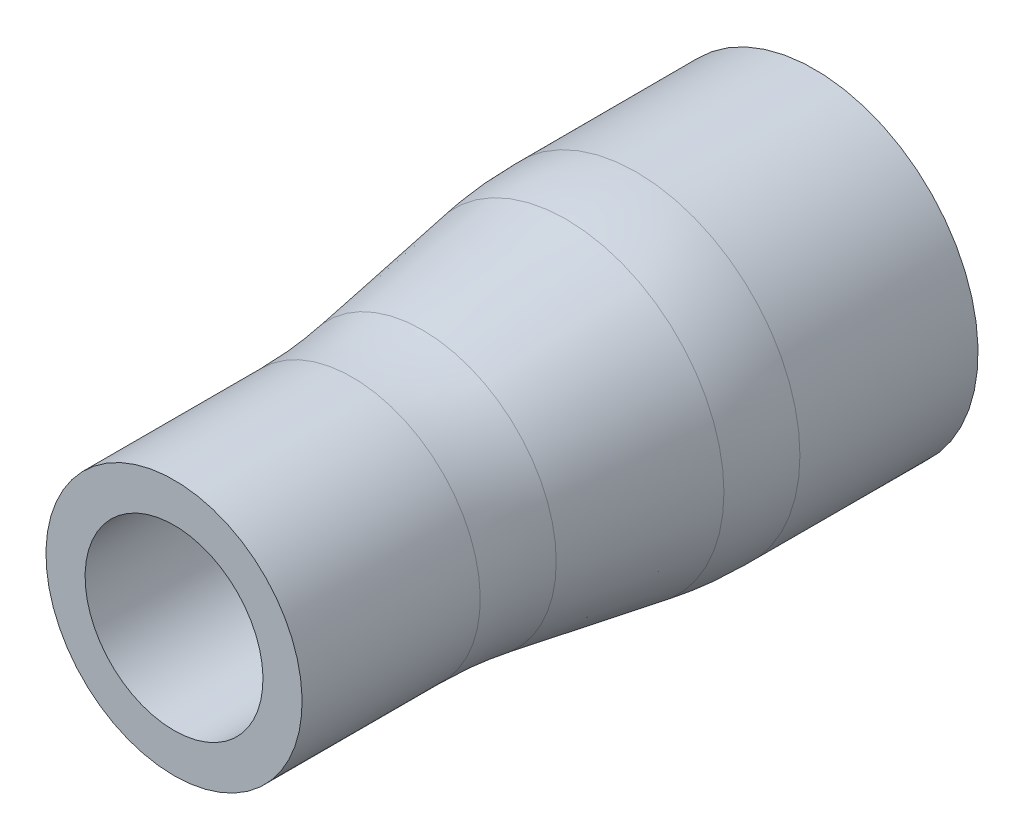
ISO-10303-21;
HEADER;
FILE_DESCRIPTION(('STEP AP214'),'2;1');
FILE_NAME('part.step','',(''),(''),'','','');
FILE_SCHEMA(('AUTOMOTIVE_DESIGN { 1 0 10303 214 1 1 1 1 }'));
ENDSEC;
DATA;
#1=APPLICATION_CONTEXT('core data for automotive mechanical design processes');
#2=APPLICATION_PROTOCOL_DEFINITION('international standard','automotive_design',2000,#1);
#3=PRODUCT_CONTEXT('',#1,'mechanical');
#4=PRODUCT('Part','Part','',(#3));
#5=PRODUCT_RELATED_PRODUCT_CATEGORY('part','',(#4));
#6=PRODUCT_DEFINITION_FORMATION('','',#4);
#7=PRODUCT_DEFINITION_CONTEXT('part definition',#1,'design');
#8=PRODUCT_DEFINITION('design','',#6,#7);
#9=PRODUCT_DEFINITION_SHAPE('','',#8);
#10=(LENGTH_UNIT() NAMED_UNIT(*) SI_UNIT(.MILLI.,.METRE.));
#11=(NAMED_UNIT(*) PLANE_ANGLE_UNIT() SI_UNIT($,.RADIAN.));
#12=(NAMED_UNIT(*) SI_UNIT($,.STERADIAN.) SOLID_ANGLE_UNIT());
#13=UNCERTAINTY_MEASURE_WITH_UNIT(LENGTH_MEASURE(1.E-05),#10,'distance_accuracy_value','');
#14=(GEOMETRIC_REPRESENTATION_CONTEXT(3) GLOBAL_UNCERTAINTY_ASSIGNED_CONTEXT((#13)) GLOBAL_UNIT_ASSIGNED_CONTEXT((#10,
#11,#12)) REPRESENTATION_CONTEXT('',''));
#15=CARTESIAN_POINT('',(0.,0.,0.));
#16=DIRECTION('',(0.,0.,1.));
#17=DIRECTION('',(1.,0.,0.));
#18=AXIS2_PLACEMENT_3D('',#15,#16,#17);
#19=CARTESIAN_POINT('',(0.,11.43,28.575));
#20=DIRECTION('',(0.,0.,-1.));
#21=DIRECTION('',(0.,1.,0.));
#22=AXIS2_PLACEMENT_3D('',#19,#20,#21);
#23=PLANE('',#22);
#24=CARTESIAN_POINT('',(0.,0.,28.575));
#25=DIRECTION('',(0.,0.,1.));
#26=DIRECTION('',(0.,-1.,0.));
#27=AXIS2_PLACEMENT_3D('',#24,#25,#26);
#28=CIRCLE('',#27,7.9375);
#29=CARTESIAN_POINT('',(0.,-7.9375,28.575));
#30=VERTEX_POINT('',#29);
#31=EDGE_CURVE('E66',#30,#30,#28,.T.);
#32=ORIENTED_EDGE('',*,*,#31,.F.);
#33=EDGE_LOOP('',(#32));
#34=FACE_BOUND('',#33,.T.);
#35=CARTESIAN_POINT('',(0.,0.,28.575));
#36=DIRECTION('',(0.,0.,1.));
#37=DIRECTION('',(0.,-1.,0.));
#38=AXIS2_PLACEMENT_3D('',#35,#36,#37);
#39=CIRCLE('',#38,11.43);
#40=CARTESIAN_POINT('',(0.,-11.43,28.575));
#41=VERTEX_POINT('',#40);
#42=EDGE_CURVE('E75',#41,#41,#39,.T.);
#43=ORIENTED_EDGE('',*,*,#42,.T.);
#44=EDGE_LOOP('',(#43));
#45=FACE_BOUND('',#44,.T.);
#46=ADVANCED_FACE('F34',(#34,#45),#23,.F.);
#47=CARTESIAN_POINT('',(0.,0.,28.575));
#48=DIRECTION('',(0.,0.,1.));
#49=DIRECTION('',(0.,-1.,0.));
#50=AXIS2_PLACEMENT_3D('',#47,#48,#49);
#51=CYLINDRICAL_SURFACE('',#50,7.9375);
#52=CARTESIAN_POINT('',(0.,0.,11.1097534519865));
#53=DIRECTION('',(0.,0.,-1.));
#54=DIRECTION('',(0.,1.,0.));
#55=AXIS2_PLACEMENT_3D('',#52,#53,#54);
#56=CIRCLE('',#55,7.9375);
#57=CARTESIAN_POINT('',(0.,7.9375,11.1097534519865));
#58=VERTEX_POINT('',#57);
#59=EDGE_CURVE('E57',#58,#58,#56,.T.);
#60=ORIENTED_EDGE('',*,*,#59,.T.);
#61=EDGE_LOOP('',(#60));
#62=FACE_BOUND('',#61,.T.);
#63=ORIENTED_EDGE('',*,*,#31,.T.);
#64=EDGE_LOOP('',(#63));
#65=FACE_BOUND('',#64,.T.);
#66=ADVANCED_FACE('F96',(#62,#65),#51,.F.);
#67=CARTESIAN_POINT('',(0.,0.,9.525));
#68=DIRECTION('',(0.,0.,-1.));
#69=DIRECTION('',(0.,1.,0.));
#70=AXIS2_PLACEMENT_3D('',#67,#68,#69);
#71=CONICAL_SURFACE('',#70,7.9375,0.0831412318884409);
#72=CARTESIAN_POINT('',(0.,0.,7.94572066955904));
#73=DIRECTION('',(0.,0.,1.));
#74=DIRECTION('',(0.,-1.,0.));
#75=AXIS2_PLACEMENT_3D('',#72,#73,#74);
#76=CIRCLE('',#75,8.06910661087008);
#77=CARTESIAN_POINT('',(0.,-8.06910661087007,7.94572066955903));
#78=VERTEX_POINT('',#77);
#79=EDGE_CURVE('E60',#78,#78,#76,.T.);
#80=ORIENTED_EDGE('',*,*,#79,.T.);
#81=EDGE_LOOP('',(#80));
#82=FACE_BOUND('',#81,.T.);
#83=CARTESIAN_POINT('',(0.,0.,-7.94572066955905));
#84=DIRECTION('',(0.,0.,-1.));
#85=DIRECTION('',(0.,1.,0.));
#86=AXIS2_PLACEMENT_3D('',#83,#84,#85);
#87=CIRCLE('',#86,9.39339338912991);
#88=CARTESIAN_POINT('',(0.,9.39339338912992,-7.94572066955905));
#89=VERTEX_POINT('',#88);
#90=EDGE_CURVE('E63',#89,#89,#87,.T.);
#91=ORIENTED_EDGE('',*,*,#90,.T.);
#92=EDGE_LOOP('',(#91));
#93=FACE_BOUND('',#92,.T.);
#94=ADVANCED_FACE('F102',(#82,#93),#71,.F.);
#95=CARTESIAN_POINT('',(0.,0.,28.575));
#96=DIRECTION('',(0.,0.,1.));
#97=DIRECTION('',(0.,-1.,0.));
#98=AXIS2_PLACEMENT_3D('',#95,#96,#97);
#99=CYLINDRICAL_SURFACE('',#98,9.52499999999999);
#100=CARTESIAN_POINT('',(0.,0.,-11.1097534519865));
#101=DIRECTION('',(0.,0.,1.));
#102=DIRECTION('',(0.,-1.,0.));
#103=AXIS2_PLACEMENT_3D('',#100,#101,#102);
#104=CIRCLE('',#103,9.52499999999999);
#105=CARTESIAN_POINT('',(0.,-9.52499999999998,-11.1097534519865));
#106=VERTEX_POINT('',#105);
#107=EDGE_CURVE('E54',#106,#106,#104,.T.);
#108=ORIENTED_EDGE('',*,*,#107,.T.);
#109=EDGE_LOOP('',(#108));
#110=FACE_BOUND('',#109,.T.);
#111=CARTESIAN_POINT('',(0.,0.,-28.575));
#112=DIRECTION('',(0.,0.,1.));
#113=DIRECTION('',(0.,-1.,0.));
#114=AXIS2_PLACEMENT_3D('',#111,#112,#113);
#115=CIRCLE('',#114,9.52499999999999);
#116=CARTESIAN_POINT('',(0.,-9.52499999999998,-28.575));
#117=VERTEX_POINT('',#116);
#118=EDGE_CURVE('E69',#117,#117,#115,.T.);
#119=ORIENTED_EDGE('',*,*,#118,.F.);
#120=EDGE_LOOP('',(#119));
#121=FACE_BOUND('',#120,.T.);
#122=ADVANCED_FACE('F166',(#110,#121),#99,.F.);
#123=CARTESIAN_POINT('',(0.,14.605,-28.575));
#124=DIRECTION('',(0.,0.,1.));
#125=DIRECTION('',(0.,-1.,0.));
#126=AXIS2_PLACEMENT_3D('',#123,#124,#125);
#127=PLANE('',#126);
#128=CARTESIAN_POINT('',(0.,0.,-28.575));
#129=DIRECTION('',(0.,0.,1.));
#130=DIRECTION('',(0.,-1.,0.));
#131=AXIS2_PLACEMENT_3D('',#128,#129,#130);
#132=CIRCLE('',#131,14.605);
#133=CARTESIAN_POINT('',(0.,-14.605,-28.575));
#134=VERTEX_POINT('',#133);
#135=EDGE_CURVE('E72',#134,#134,#132,.T.);
#136=ORIENTED_EDGE('',*,*,#135,.F.);
#137=EDGE_LOOP('',(#136));
#138=FACE_BOUND('',#137,.T.);
#139=ORIENTED_EDGE('',*,*,#118,.T.);
#140=EDGE_LOOP('',(#139));
#141=FACE_BOUND('',#140,.T.);
#142=ADVANCED_FACE('F159',(#138,#141),#127,.F.);
#143=CARTESIAN_POINT('',(0.,0.,28.575));
#144=DIRECTION('',(0.,0.,1.));
#145=DIRECTION('',(0.,-1.,0.));
#146=AXIS2_PLACEMENT_3D('',#143,#144,#145);
#147=CYLINDRICAL_SURFACE('',#146,14.605);
#148=CARTESIAN_POINT('',(0.,0.,-12.6782524043622));
#149=DIRECTION('',(0.,0.,-1.));
#150=DIRECTION('',(0.,1.,0.));
#151=AXIS2_PLACEMENT_3D('',#148,#149,#150);
#152=CIRCLE('',#151,14.605);
#153=CARTESIAN_POINT('',(0.,14.605,-12.6782524043621));
#154=VERTEX_POINT('',#153);
#155=EDGE_CURVE('E41',#154,#154,#152,.T.);
#156=ORIENTED_EDGE('',*,*,#155,.T.);
#157=EDGE_LOOP('',(#156));
#158=FACE_BOUND('',#157,.T.);
#159=ORIENTED_EDGE('',*,*,#135,.T.);
#160=EDGE_LOOP('',(#159));
#161=FACE_BOUND('',#160,.T.);
#162=ADVANCED_FACE('F92',(#158,#161),#147,.T.);
#163=CARTESIAN_POINT('',(0.,0.,-9.525));
#164=DIRECTION('',(0.,0.,-1.));
#165=DIRECTION('',(0.,1.,0.));
#166=AXIS2_PLACEMENT_3D('',#163,#164,#165);
#167=CONICAL_SURFACE('',#166,14.605,0.165148677414626);
#168=CARTESIAN_POINT('',(0.,0.,-6.41465098802808));
#169=DIRECTION('',(0.,0.,1.));
#170=DIRECTION('',(0.,-1.,0.));
#171=AXIS2_PLACEMENT_3D('',#168,#169,#170);
#172=CIRCLE('',#171,14.0866084980047);
#173=CARTESIAN_POINT('',(0.,-14.0866084980047,-6.41465098802809));
#174=VERTEX_POINT('',#173);
#175=EDGE_CURVE('E45',#174,#174,#172,.T.);
#176=ORIENTED_EDGE('',*,*,#175,.T.);
#177=EDGE_LOOP('',(#176));
#178=FACE_BOUND('',#177,.T.);
#179=CARTESIAN_POINT('',(0.,0.,6.41465098802804));
#180=DIRECTION('',(0.,0.,-1.));
#181=DIRECTION('',(0.,1.,0.));
#182=AXIS2_PLACEMENT_3D('',#179,#180,#181);
#183=CIRCLE('',#182,11.9483915019953);
#184=CARTESIAN_POINT('',(0.,11.9483915019953,6.41465098802804));
#185=VERTEX_POINT('',#184);
#186=EDGE_CURVE('E49',#185,#185,#183,.T.);
#187=ORIENTED_EDGE('',*,*,#186,.T.);
#188=EDGE_LOOP('',(#187));
#189=FACE_BOUND('',#188,.T.);
#190=ADVANCED_FACE('F83',(#178,#189),#167,.T.);
#191=CARTESIAN_POINT('',(0.,0.,28.575));
#192=DIRECTION('',(0.,0.,1.));
#193=DIRECTION('',(0.,-1.,0.));
#194=AXIS2_PLACEMENT_3D('',#191,#192,#193);
#195=CYLINDRICAL_SURFACE('',#194,11.43);
#196=CARTESIAN_POINT('',(0.,0.,12.6782524043621));
#197=DIRECTION('',(0.,0.,1.));
#198=DIRECTION('',(0.,-1.,0.));
#199=AXIS2_PLACEMENT_3D('',#196,#197,#198);
#200=CIRCLE('',#199,11.43);
#201=CARTESIAN_POINT('',(0.,-11.43,12.6782524043621));
#202=VERTEX_POINT('',#201);
#203=EDGE_CURVE('E10',#202,#202,#200,.T.);
#204=ORIENTED_EDGE('',*,*,#203,.T.);
#205=EDGE_LOOP('',(#204));
#206=FACE_BOUND('',#205,.T.);
#207=ORIENTED_EDGE('',*,*,#42,.F.);
#208=EDGE_LOOP('',(#207));
#209=FACE_BOUND('',#208,.T.);
#210=ADVANCED_FACE('F80',(#206,#209),#195,.T.);
#211=CARTESIAN_POINT('',(0.,0.,11.1097534519865));
#212=DIRECTION('',(0.,0.,-1.));
#213=DIRECTION('',(0.,1.,0.));
#214=AXIS2_PLACEMENT_3D('',#211,#212,#213);
#215=TOROIDAL_SURFACE('',#214,46.0375,38.1);
#216=ORIENTED_EDGE('',*,*,#59,.F.);
#217=EDGE_LOOP('',(#216));
#218=FACE_BOUND('',#217,.T.);
#219=ORIENTED_EDGE('',*,*,#79,.F.);
#220=EDGE_LOOP('',(#219));
#221=FACE_BOUND('',#220,.T.);
#222=ADVANCED_FACE('F82',(#218,#221),#215,.T.);
#223=CARTESIAN_POINT('',(0.,0.,-11.1097534519865));
#224=DIRECTION('',(0.,0.,1.));
#225=DIRECTION('',(0.,-1.,0.));
#226=AXIS2_PLACEMENT_3D('',#223,#224,#225);
#227=DEGENERATE_TOROIDAL_SURFACE('',#226,28.575,38.1,.F.);
#228=ORIENTED_EDGE('',*,*,#90,.F.);
#229=EDGE_LOOP('',(#228));
#230=FACE_BOUND('',#229,.T.);
#231=ORIENTED_EDGE('',*,*,#107,.F.);
#232=EDGE_LOOP('',(#231));
#233=FACE_BOUND('',#232,.T.);
#234=ADVANCED_FACE('F89',(#230,#233),#227,.T.);
#235=CARTESIAN_POINT('',(0.,0.,-12.6782524043622));
#236=DIRECTION('',(0.,0.,-1.));
#237=DIRECTION('',(0.,1.,0.));
#238=AXIS2_PLACEMENT_3D('',#235,#236,#237);
#239=DEGENERATE_TOROIDAL_SURFACE('',#238,23.495,38.1,.F.);
#240=ORIENTED_EDGE('',*,*,#155,.F.);
#241=EDGE_LOOP('',(#240));
#242=FACE_BOUND('',#241,.T.);
#243=ORIENTED_EDGE('',*,*,#175,.F.);
#244=EDGE_LOOP('',(#243));
#245=FACE_BOUND('',#244,.T.);
#246=ADVANCED_FACE('F109',(#242,#245),#239,.F.);
#247=CARTESIAN_POINT('',(0.,0.,12.6782524043621));
#248=DIRECTION('',(0.,0.,1.));
#249=DIRECTION('',(0.,-1.,0.));
#250=AXIS2_PLACEMENT_3D('',#247,#248,#249);
#251=TOROIDAL_SURFACE('',#250,49.53,38.1);
#252=ORIENTED_EDGE('',*,*,#186,.F.);
#253=EDGE_LOOP('',(#252));
#254=FACE_BOUND('',#253,.T.);
#255=ORIENTED_EDGE('',*,*,#203,.F.);
#256=EDGE_LOOP('',(#255));
#257=FACE_BOUND('',#256,.T.);
#258=ADVANCED_FACE('F36',(#254,#257),#251,.F.);
#259=CLOSED_SHELL('',(#46,#66,#94,#122,#142,#162,#190,#210,#222,#234,#246,#258));
#260=MANIFOLD_SOLID_BREP('B2',#259);
#261=ADVANCED_BREP_SHAPE_REPRESENTATION('',(#18,#260),#14);
#262=SHAPE_DEFINITION_REPRESENTATION(#9,#261);
ENDSEC;
END-ISO-10303-21;
